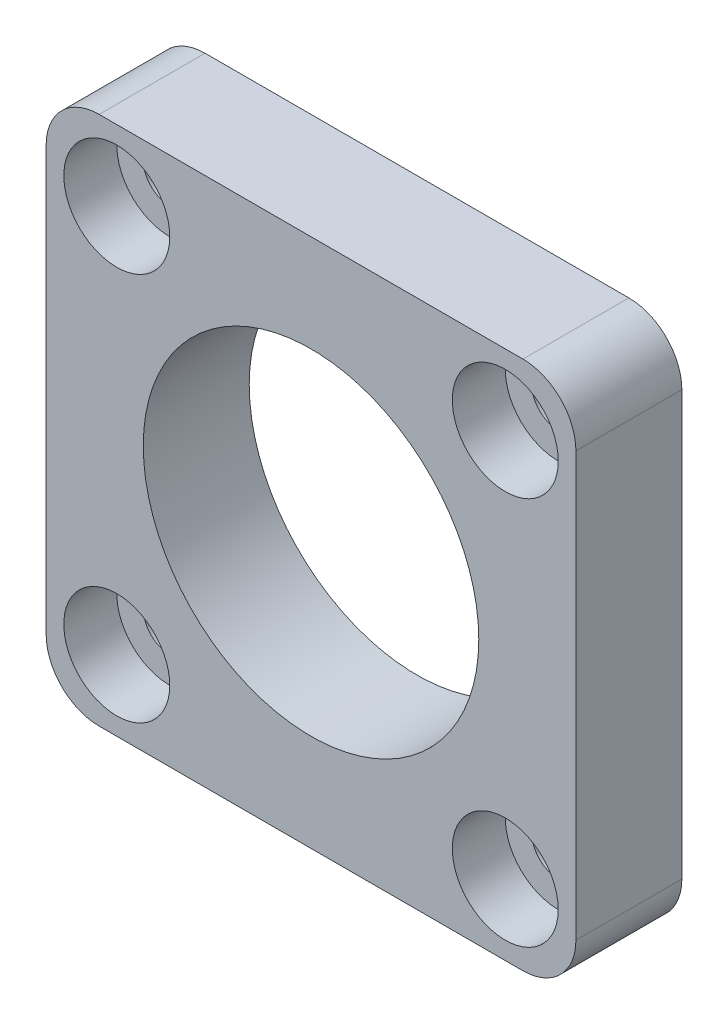
ISO-10303-21;
HEADER;
FILE_DESCRIPTION(('STEP AP214'),'2;1');
FILE_NAME('part.step','',(''),(''),'','','');
FILE_SCHEMA(('AUTOMOTIVE_DESIGN { 1 0 10303 214 1 1 1 1 }'));
ENDSEC;
DATA;
#1=APPLICATION_CONTEXT('core data for automotive mechanical design processes');
#2=APPLICATION_PROTOCOL_DEFINITION('international standard','automotive_design',2000,#1);
#3=PRODUCT_CONTEXT('',#1,'mechanical');
#4=PRODUCT('Part','Part','',(#3));
#5=PRODUCT_RELATED_PRODUCT_CATEGORY('part','',(#4));
#6=PRODUCT_DEFINITION_FORMATION('','',#4);
#7=PRODUCT_DEFINITION_CONTEXT('part definition',#1,'design');
#8=PRODUCT_DEFINITION('design','',#6,#7);
#9=PRODUCT_DEFINITION_SHAPE('','',#8);
#10=(LENGTH_UNIT() NAMED_UNIT(*) SI_UNIT(.MILLI.,.METRE.));
#11=(NAMED_UNIT(*) PLANE_ANGLE_UNIT() SI_UNIT($,.RADIAN.));
#12=(NAMED_UNIT(*) SI_UNIT($,.STERADIAN.) SOLID_ANGLE_UNIT());
#13=UNCERTAINTY_MEASURE_WITH_UNIT(LENGTH_MEASURE(1.E-05),#10,'distance_accuracy_value','');
#14=(GEOMETRIC_REPRESENTATION_CONTEXT(3) GLOBAL_UNCERTAINTY_ASSIGNED_CONTEXT((#13)) GLOBAL_UNIT_ASSIGNED_CONTEXT((#10,
#11,#12)) REPRESENTATION_CONTEXT('',''));
#15=CARTESIAN_POINT('',(0.,0.,0.));
#16=DIRECTION('',(0.,0.,1.));
#17=DIRECTION('',(1.,0.,0.));
#18=AXIS2_PLACEMENT_3D('',#15,#16,#17);
#19=CARTESIAN_POINT('',(-11.,-11.,0.));
#20=DIRECTION('',(0.,0.,1.));
#21=DIRECTION('',(1.,0.,0.));
#22=AXIS2_PLACEMENT_3D('',#19,#20,#21);
#23=CYLINDRICAL_SURFACE('',#22,1.5);
#24=CARTESIAN_POINT('',(-11.,-11.,0.));
#25=DIRECTION('',(0.,0.,1.));
#26=DIRECTION('',(1.,0.,0.));
#27=AXIS2_PLACEMENT_3D('',#24,#25,#26);
#28=CIRCLE('',#27,1.5);
#29=CARTESIAN_POINT('',(-9.5,-11.,0.));
#30=VERTEX_POINT('',#29);
#31=EDGE_CURVE('E137',#30,#30,#28,.T.);
#32=ORIENTED_EDGE('',*,*,#31,.F.);
#33=EDGE_LOOP('',(#32));
#34=FACE_BOUND('',#33,.T.);
#35=CARTESIAN_POINT('',(-11.,-11.,3.));
#36=DIRECTION('',(0.,0.,1.));
#37=DIRECTION('',(1.,0.,0.));
#38=AXIS2_PLACEMENT_3D('',#35,#36,#37);
#39=CIRCLE('',#38,1.5);
#40=CARTESIAN_POINT('',(-9.5,-11.,3.));
#41=VERTEX_POINT('',#40);
#42=EDGE_CURVE('E149',#41,#41,#39,.F.);
#43=ORIENTED_EDGE('',*,*,#42,.F.);
#44=EDGE_LOOP('',(#43));
#45=FACE_BOUND('',#44,.T.);
#46=ADVANCED_FACE('F32',(#34,#45),#23,.F.);
#47=CARTESIAN_POINT('',(11.,-11.,0.));
#48=DIRECTION('',(0.,0.,1.));
#49=DIRECTION('',(1.,0.,0.));
#50=AXIS2_PLACEMENT_3D('',#47,#48,#49);
#51=CYLINDRICAL_SURFACE('',#50,1.5);
#52=CARTESIAN_POINT('',(11.,-11.,0.));
#53=DIRECTION('',(0.,0.,1.));
#54=DIRECTION('',(1.,0.,0.));
#55=AXIS2_PLACEMENT_3D('',#52,#53,#54);
#56=CIRCLE('',#55,1.5);
#57=CARTESIAN_POINT('',(12.5,-11.,0.));
#58=VERTEX_POINT('',#57);
#59=EDGE_CURVE('E202',#58,#58,#56,.T.);
#60=ORIENTED_EDGE('',*,*,#59,.F.);
#61=EDGE_LOOP('',(#60));
#62=FACE_BOUND('',#61,.T.);
#63=CARTESIAN_POINT('',(11.,-11.,3.));
#64=DIRECTION('',(0.,0.,1.));
#65=DIRECTION('',(1.,0.,0.));
#66=AXIS2_PLACEMENT_3D('',#63,#64,#65);
#67=CIRCLE('',#66,1.5);
#68=CARTESIAN_POINT('',(12.5,-11.,3.));
#69=VERTEX_POINT('',#68);
#70=EDGE_CURVE('E144',#69,#69,#67,.F.);
#71=ORIENTED_EDGE('',*,*,#70,.F.);
#72=EDGE_LOOP('',(#71));
#73=FACE_BOUND('',#72,.T.);
#74=ADVANCED_FACE('F265',(#62,#73),#51,.F.);
#75=CARTESIAN_POINT('',(11.,11.,0.));
#76=DIRECTION('',(0.,0.,1.));
#77=DIRECTION('',(1.,0.,0.));
#78=AXIS2_PLACEMENT_3D('',#75,#76,#77);
#79=CYLINDRICAL_SURFACE('',#78,1.5);
#80=CARTESIAN_POINT('',(11.,11.,0.));
#81=DIRECTION('',(0.,0.,1.));
#82=DIRECTION('',(1.,0.,0.));
#83=AXIS2_PLACEMENT_3D('',#80,#81,#82);
#84=CIRCLE('',#83,1.5);
#85=CARTESIAN_POINT('',(12.5,11.,0.));
#86=VERTEX_POINT('',#85);
#87=EDGE_CURVE('E199',#86,#86,#84,.T.);
#88=ORIENTED_EDGE('',*,*,#87,.F.);
#89=EDGE_LOOP('',(#88));
#90=FACE_BOUND('',#89,.T.);
#91=CARTESIAN_POINT('',(11.,11.,3.));
#92=DIRECTION('',(0.,0.,1.));
#93=DIRECTION('',(1.,0.,0.));
#94=AXIS2_PLACEMENT_3D('',#91,#92,#93);
#95=CIRCLE('',#94,1.5);
#96=CARTESIAN_POINT('',(12.5,11.,3.));
#97=VERTEX_POINT('',#96);
#98=EDGE_CURVE('E139',#97,#97,#95,.F.);
#99=ORIENTED_EDGE('',*,*,#98,.F.);
#100=EDGE_LOOP('',(#99));
#101=FACE_BOUND('',#100,.T.);
#102=ADVANCED_FACE('F271',(#90,#101),#79,.F.);
#103=CARTESIAN_POINT('',(-11.,11.,0.));
#104=DIRECTION('',(0.,0.,1.));
#105=DIRECTION('',(1.,0.,0.));
#106=AXIS2_PLACEMENT_3D('',#103,#104,#105);
#107=CYLINDRICAL_SURFACE('',#106,1.5);
#108=CARTESIAN_POINT('',(-11.,11.,0.));
#109=DIRECTION('',(0.,0.,1.));
#110=DIRECTION('',(1.,0.,0.));
#111=AXIS2_PLACEMENT_3D('',#108,#109,#110);
#112=CIRCLE('',#111,1.5);
#113=CARTESIAN_POINT('',(-9.5,11.,0.));
#114=VERTEX_POINT('',#113);
#115=EDGE_CURVE('E195',#114,#114,#112,.T.);
#116=ORIENTED_EDGE('',*,*,#115,.F.);
#117=EDGE_LOOP('',(#116));
#118=FACE_BOUND('',#117,.T.);
#119=CARTESIAN_POINT('',(-11.,11.,3.));
#120=DIRECTION('',(0.,0.,1.));
#121=DIRECTION('',(1.,0.,0.));
#122=AXIS2_PLACEMENT_3D('',#119,#120,#121);
#123=CIRCLE('',#122,1.5);
#124=CARTESIAN_POINT('',(-9.5,11.,3.));
#125=VERTEX_POINT('',#124);
#126=EDGE_CURVE('E134',#125,#125,#123,.F.);
#127=ORIENTED_EDGE('',*,*,#126,.F.);
#128=EDGE_LOOP('',(#127));
#129=FACE_BOUND('',#128,.T.);
#130=ADVANCED_FACE('F237',(#118,#129),#107,.F.);
#131=CARTESIAN_POINT('',(0.,0.,6.));
#132=DIRECTION('',(0.,0.,-1.));
#133=DIRECTION('',(-1.,0.,0.));
#134=AXIS2_PLACEMENT_3D('',#131,#132,#133);
#135=PLANE('',#134);
#136=CARTESIAN_POINT('',(-11.,-11.,6.));
#137=DIRECTION('',(0.,0.,1.));
#138=DIRECTION('',(1.,0.,0.));
#139=AXIS2_PLACEMENT_3D('',#136,#137,#138);
#140=CIRCLE('',#139,3.);
#141=CARTESIAN_POINT('',(-8.,-11.,6.));
#142=VERTEX_POINT('',#141);
#143=EDGE_CURVE('E219',#142,#142,#140,.T.);
#144=ORIENTED_EDGE('',*,*,#143,.F.);
#145=EDGE_LOOP('',(#144));
#146=FACE_BOUND('',#145,.T.);
#147=CARTESIAN_POINT('',(11.,-11.,6.));
#148=DIRECTION('',(0.,0.,1.));
#149=DIRECTION('',(1.,0.,0.));
#150=AXIS2_PLACEMENT_3D('',#147,#148,#149);
#151=CIRCLE('',#150,3.);
#152=CARTESIAN_POINT('',(14.,-11.,6.));
#153=VERTEX_POINT('',#152);
#154=EDGE_CURVE('E152',#153,#153,#151,.T.);
#155=ORIENTED_EDGE('',*,*,#154,.F.);
#156=EDGE_LOOP('',(#155));
#157=FACE_BOUND('',#156,.T.);
#158=CARTESIAN_POINT('',(11.,11.,6.));
#159=DIRECTION('',(0.,0.,1.));
#160=DIRECTION('',(1.,0.,0.));
#161=AXIS2_PLACEMENT_3D('',#158,#159,#160);
#162=CIRCLE('',#161,3.);
#163=CARTESIAN_POINT('',(14.,11.,6.));
#164=VERTEX_POINT('',#163);
#165=EDGE_CURVE('E147',#164,#164,#162,.T.);
#166=ORIENTED_EDGE('',*,*,#165,.F.);
#167=EDGE_LOOP('',(#166));
#168=FACE_BOUND('',#167,.T.);
#169=CARTESIAN_POINT('',(-11.,11.,6.));
#170=DIRECTION('',(0.,0.,1.));
#171=DIRECTION('',(1.,0.,0.));
#172=AXIS2_PLACEMENT_3D('',#169,#170,#171);
#173=CIRCLE('',#172,3.);
#174=CARTESIAN_POINT('',(-8.,11.,6.));
#175=VERTEX_POINT('',#174);
#176=EDGE_CURVE('E142',#175,#175,#173,.T.);
#177=ORIENTED_EDGE('',*,*,#176,.F.);
#178=EDGE_LOOP('',(#177));
#179=FACE_BOUND('',#178,.T.);
#180=DIRECTION('',(0.,-1.,0.));
#181=VECTOR('',#180,1.);
#182=CARTESIAN_POINT('',(-15.,-15.,6.));
#183=LINE('',#182,#181);
#184=CARTESIAN_POINT('',(-15.,12.,6.));
#185=VERTEX_POINT('',#184);
#186=CARTESIAN_POINT('',(-15.,-12.,6.));
#187=VERTEX_POINT('',#186);
#188=EDGE_CURVE('E190',#185,#187,#183,.T.);
#189=ORIENTED_EDGE('',*,*,#188,.T.);
#190=CARTESIAN_POINT('',(-12.,-12.,6.));
#191=DIRECTION('',(0.,0.,-1.));
#192=DIRECTION('',(-1.,0.,0.));
#193=AXIS2_PLACEMENT_3D('',#190,#191,#192);
#194=CIRCLE('',#193,3.);
#195=CARTESIAN_POINT('',(-12.,-15.,6.));
#196=VERTEX_POINT('',#195);
#197=EDGE_CURVE('E167',#187,#196,#194,.F.);
#198=ORIENTED_EDGE('',*,*,#197,.T.);
#199=DIRECTION('',(1.,0.,0.));
#200=VECTOR('',#199,1.);
#201=CARTESIAN_POINT('',(-15.,-15.,6.));
#202=LINE('',#201,#200);
#203=CARTESIAN_POINT('',(12.,-15.,6.));
#204=VERTEX_POINT('',#203);
#205=EDGE_CURVE('E118',#196,#204,#202,.T.);
#206=ORIENTED_EDGE('',*,*,#205,.T.);
#207=CARTESIAN_POINT('',(12.,-12.,6.));
#208=DIRECTION('',(0.,0.,-1.));
#209=DIRECTION('',(-1.,0.,0.));
#210=AXIS2_PLACEMENT_3D('',#207,#208,#209);
#211=CIRCLE('',#210,3.);
#212=CARTESIAN_POINT('',(15.,-12.,6.));
#213=VERTEX_POINT('',#212);
#214=EDGE_CURVE('E165',#204,#213,#211,.F.);
#215=ORIENTED_EDGE('',*,*,#214,.T.);
#216=DIRECTION('',(0.,1.,0.));
#217=VECTOR('',#216,1.);
#218=CARTESIAN_POINT('',(15.,-15.,6.));
#219=LINE('',#218,#217);
#220=CARTESIAN_POINT('',(15.,12.,6.));
#221=VERTEX_POINT('',#220);
#222=EDGE_CURVE('E125',#213,#221,#219,.T.);
#223=ORIENTED_EDGE('',*,*,#222,.T.);
#224=CARTESIAN_POINT('',(12.,12.,6.));
#225=DIRECTION('',(0.,0.,-1.));
#226=DIRECTION('',(-1.,0.,0.));
#227=AXIS2_PLACEMENT_3D('',#224,#225,#226);
#228=CIRCLE('',#227,3.);
#229=CARTESIAN_POINT('',(12.,15.,6.));
#230=VERTEX_POINT('',#229);
#231=EDGE_CURVE('E53',#221,#230,#228,.F.);
#232=ORIENTED_EDGE('',*,*,#231,.T.);
#233=DIRECTION('',(-1.,0.,0.));
#234=VECTOR('',#233,1.);
#235=CARTESIAN_POINT('',(-15.,15.,6.));
#236=LINE('',#235,#234);
#237=CARTESIAN_POINT('',(-12.,15.,6.));
#238=VERTEX_POINT('',#237);
#239=EDGE_CURVE('E128',#230,#238,#236,.T.);
#240=ORIENTED_EDGE('',*,*,#239,.T.);
#241=CARTESIAN_POINT('',(-12.,12.,6.));
#242=DIRECTION('',(0.,0.,-1.));
#243=DIRECTION('',(-1.,0.,0.));
#244=AXIS2_PLACEMENT_3D('',#241,#242,#243);
#245=CIRCLE('',#244,3.);
#246=EDGE_CURVE('E162',#238,#185,#245,.F.);
#247=ORIENTED_EDGE('',*,*,#246,.T.);
#248=EDGE_LOOP('',(#189,#198,#206,#215,#223,#232,#240,#247));
#249=FACE_BOUND('',#248,.T.);
#250=CARTESIAN_POINT('',(0.,0.,6.));
#251=DIRECTION('',(0.,0.,1.));
#252=DIRECTION('',(1.,0.,0.));
#253=AXIS2_PLACEMENT_3D('',#250,#251,#252);
#254=CIRCLE('',#253,9.5);
#255=CARTESIAN_POINT('',(9.5,0.,6.));
#256=VERTEX_POINT('',#255);
#257=EDGE_CURVE('E183',#256,#256,#254,.T.);
#258=ORIENTED_EDGE('',*,*,#257,.F.);
#259=EDGE_LOOP('',(#258));
#260=FACE_BOUND('',#259,.T.);
#261=ADVANCED_FACE('F234',(#146,#157,#168,#179,#249,#260),#135,.F.);
#262=CARTESIAN_POINT('',(0.,0.,0.));
#263=DIRECTION('',(0.,0.,-1.));
#264=DIRECTION('',(-1.,0.,0.));
#265=AXIS2_PLACEMENT_3D('',#262,#263,#264);
#266=PLANE('',#265);
#267=ORIENTED_EDGE('',*,*,#31,.T.);
#268=EDGE_LOOP('',(#267));
#269=FACE_BOUND('',#268,.T.);
#270=ORIENTED_EDGE('',*,*,#59,.T.);
#271=EDGE_LOOP('',(#270));
#272=FACE_BOUND('',#271,.T.);
#273=ORIENTED_EDGE('',*,*,#87,.T.);
#274=EDGE_LOOP('',(#273));
#275=FACE_BOUND('',#274,.T.);
#276=ORIENTED_EDGE('',*,*,#115,.T.);
#277=EDGE_LOOP('',(#276));
#278=FACE_BOUND('',#277,.T.);
#279=DIRECTION('',(1.,0.,0.));
#280=VECTOR('',#279,1.);
#281=CARTESIAN_POINT('',(-15.,-15.,0.));
#282=LINE('',#281,#280);
#283=CARTESIAN_POINT('',(-12.,-15.,0.));
#284=VERTEX_POINT('',#283);
#285=CARTESIAN_POINT('',(12.,-15.,0.));
#286=VERTEX_POINT('',#285);
#287=EDGE_CURVE('E115',#284,#286,#282,.T.);
#288=ORIENTED_EDGE('',*,*,#287,.F.);
#289=CARTESIAN_POINT('',(-12.,-12.,0.));
#290=DIRECTION('',(0.,0.,-1.));
#291=DIRECTION('',(-1.,0.,0.));
#292=AXIS2_PLACEMENT_3D('',#289,#290,#291);
#293=CIRCLE('',#292,3.);
#294=CARTESIAN_POINT('',(-15.,-12.,0.));
#295=VERTEX_POINT('',#294);
#296=EDGE_CURVE('E98',#284,#295,#293,.T.);
#297=ORIENTED_EDGE('',*,*,#296,.T.);
#298=DIRECTION('',(0.,-1.,0.));
#299=VECTOR('',#298,1.);
#300=CARTESIAN_POINT('',(-15.,-15.,0.));
#301=LINE('',#300,#299);
#302=CARTESIAN_POINT('',(-15.,12.,0.));
#303=VERTEX_POINT('',#302);
#304=EDGE_CURVE('E126',#303,#295,#301,.T.);
#305=ORIENTED_EDGE('',*,*,#304,.F.);
#306=CARTESIAN_POINT('',(-12.,12.,0.));
#307=DIRECTION('',(0.,0.,-1.));
#308=DIRECTION('',(-1.,0.,0.));
#309=AXIS2_PLACEMENT_3D('',#306,#307,#308);
#310=CIRCLE('',#309,3.);
#311=CARTESIAN_POINT('',(-12.,15.,0.));
#312=VERTEX_POINT('',#311);
#313=EDGE_CURVE('E119',#303,#312,#310,.T.);
#314=ORIENTED_EDGE('',*,*,#313,.T.);
#315=DIRECTION('',(-1.,0.,0.));
#316=VECTOR('',#315,1.);
#317=CARTESIAN_POINT('',(-15.,15.,0.));
#318=LINE('',#317,#316);
#319=CARTESIAN_POINT('',(12.,15.,0.));
#320=VERTEX_POINT('',#319);
#321=EDGE_CURVE('E130',#320,#312,#318,.T.);
#322=ORIENTED_EDGE('',*,*,#321,.F.);
#323=CARTESIAN_POINT('',(12.,12.,0.));
#324=DIRECTION('',(0.,0.,-1.));
#325=DIRECTION('',(-1.,0.,0.));
#326=AXIS2_PLACEMENT_3D('',#323,#324,#325);
#327=CIRCLE('',#326,3.);
#328=CARTESIAN_POINT('',(15.,12.,0.));
#329=VERTEX_POINT('',#328);
#330=EDGE_CURVE('E156',#320,#329,#327,.T.);
#331=ORIENTED_EDGE('',*,*,#330,.T.);
#332=DIRECTION('',(0.,1.,0.));
#333=VECTOR('',#332,1.);
#334=CARTESIAN_POINT('',(15.,-15.,0.));
#335=LINE('',#334,#333);
#336=CARTESIAN_POINT('',(15.,-12.,0.));
#337=VERTEX_POINT('',#336);
#338=EDGE_CURVE('E178',#337,#329,#335,.T.);
#339=ORIENTED_EDGE('',*,*,#338,.F.);
#340=CARTESIAN_POINT('',(12.,-12.,0.));
#341=DIRECTION('',(0.,0.,-1.));
#342=DIRECTION('',(-1.,0.,0.));
#343=AXIS2_PLACEMENT_3D('',#340,#341,#342);
#344=CIRCLE('',#343,3.);
#345=EDGE_CURVE('E109',#337,#286,#344,.T.);
#346=ORIENTED_EDGE('',*,*,#345,.T.);
#347=EDGE_LOOP('',(#288,#297,#305,#314,#322,#331,#339,#346));
#348=FACE_BOUND('',#347,.T.);
#349=CARTESIAN_POINT('',(0.,0.,0.));
#350=DIRECTION('',(0.,0.,1.));
#351=DIRECTION('',(1.,0.,0.));
#352=AXIS2_PLACEMENT_3D('',#349,#350,#351);
#353=CIRCLE('',#352,9.5);
#354=CARTESIAN_POINT('',(9.5,0.,0.));
#355=VERTEX_POINT('',#354);
#356=EDGE_CURVE('E186',#355,#355,#353,.T.);
#357=ORIENTED_EDGE('',*,*,#356,.T.);
#358=EDGE_LOOP('',(#357));
#359=FACE_BOUND('',#358,.T.);
#360=ADVANCED_FACE('F122',(#269,#272,#275,#278,#348,#359),#266,.T.);
#361=CARTESIAN_POINT('',(15.,-15.,6.));
#362=DIRECTION('',(-1.,0.,0.));
#363=DIRECTION('',(0.,0.,1.));
#364=AXIS2_PLACEMENT_3D('',#361,#362,#363);
#365=PLANE('',#364);
#366=ORIENTED_EDGE('',*,*,#222,.F.);
#367=DIRECTION('',(0.,0.,-1.));
#368=VECTOR('',#367,1.);
#369=CARTESIAN_POINT('',(15.,-12.,6.));
#370=LINE('',#369,#368);
#371=EDGE_CURVE('E171',#213,#337,#370,.T.);
#372=ORIENTED_EDGE('',*,*,#371,.T.);
#373=ORIENTED_EDGE('',*,*,#338,.T.);
#374=DIRECTION('',(0.,0.,-1.));
#375=VECTOR('',#374,1.);
#376=CARTESIAN_POINT('',(15.,12.,6.));
#377=LINE('',#376,#375);
#378=EDGE_CURVE('E169',#329,#221,#377,.F.);
#379=ORIENTED_EDGE('',*,*,#378,.T.);
#380=EDGE_LOOP('',(#366,#372,#373,#379));
#381=FACE_BOUND('',#380,.T.);
#382=ADVANCED_FACE('F177',(#381),#365,.F.);
#383=CARTESIAN_POINT('',(-15.,15.,6.));
#384=DIRECTION('',(0.,-1.,0.));
#385=DIRECTION('',(0.,0.,-1.));
#386=AXIS2_PLACEMENT_3D('',#383,#384,#385);
#387=PLANE('',#386);
#388=ORIENTED_EDGE('',*,*,#239,.F.);
#389=DIRECTION('',(0.,0.,-1.));
#390=VECTOR('',#389,1.);
#391=CARTESIAN_POINT('',(12.,15.,6.));
#392=LINE('',#391,#390);
#393=EDGE_CURVE('E11',#230,#320,#392,.T.);
#394=ORIENTED_EDGE('',*,*,#393,.T.);
#395=ORIENTED_EDGE('',*,*,#321,.T.);
#396=DIRECTION('',(0.,0.,-1.));
#397=VECTOR('',#396,1.);
#398=CARTESIAN_POINT('',(-12.,15.,6.));
#399=LINE('',#398,#397);
#400=EDGE_CURVE('E40',#312,#238,#399,.F.);
#401=ORIENTED_EDGE('',*,*,#400,.T.);
#402=EDGE_LOOP('',(#388,#394,#395,#401));
#403=FACE_BOUND('',#402,.T.);
#404=ADVANCED_FACE('F260',(#403),#387,.F.);
#405=CARTESIAN_POINT('',(-15.,-15.,6.));
#406=DIRECTION('',(1.,0.,0.));
#407=DIRECTION('',(0.,0.,-1.));
#408=AXIS2_PLACEMENT_3D('',#405,#406,#407);
#409=PLANE('',#408);
#410=ORIENTED_EDGE('',*,*,#304,.T.);
#411=DIRECTION('',(0.,0.,-1.));
#412=VECTOR('',#411,1.);
#413=CARTESIAN_POINT('',(-15.,-12.,6.));
#414=LINE('',#413,#412);
#415=EDGE_CURVE('E103',#295,#187,#414,.F.);
#416=ORIENTED_EDGE('',*,*,#415,.T.);
#417=ORIENTED_EDGE('',*,*,#188,.F.);
#418=DIRECTION('',(0.,0.,-1.));
#419=VECTOR('',#418,1.);
#420=CARTESIAN_POINT('',(-15.,12.,6.));
#421=LINE('',#420,#419);
#422=EDGE_CURVE('E108',#185,#303,#421,.T.);
#423=ORIENTED_EDGE('',*,*,#422,.T.);
#424=EDGE_LOOP('',(#410,#416,#417,#423));
#425=FACE_BOUND('',#424,.T.);
#426=ADVANCED_FACE('F421',(#425),#409,.F.);
#427=CARTESIAN_POINT('',(-15.,-15.,6.));
#428=DIRECTION('',(0.,1.,0.));
#429=DIRECTION('',(0.,0.,1.));
#430=AXIS2_PLACEMENT_3D('',#427,#428,#429);
#431=PLANE('',#430);
#432=ORIENTED_EDGE('',*,*,#205,.F.);
#433=DIRECTION('',(0.,0.,-1.));
#434=VECTOR('',#433,1.);
#435=CARTESIAN_POINT('',(-12.,-15.,6.));
#436=LINE('',#435,#434);
#437=EDGE_CURVE('E102',#196,#284,#436,.T.);
#438=ORIENTED_EDGE('',*,*,#437,.T.);
#439=ORIENTED_EDGE('',*,*,#287,.T.);
#440=DIRECTION('',(0.,0.,-1.));
#441=VECTOR('',#440,1.);
#442=CARTESIAN_POINT('',(12.,-15.,6.));
#443=LINE('',#442,#441);
#444=EDGE_CURVE('E120',#286,#204,#443,.F.);
#445=ORIENTED_EDGE('',*,*,#444,.T.);
#446=EDGE_LOOP('',(#432,#438,#439,#445));
#447=FACE_BOUND('',#446,.T.);
#448=ADVANCED_FACE('F114',(#447),#431,.F.);
#449=CARTESIAN_POINT('',(0.,0.,6.));
#450=DIRECTION('',(0.,0.,-1.));
#451=DIRECTION('',(-1.,0.,0.));
#452=AXIS2_PLACEMENT_3D('',#449,#450,#451);
#453=CYLINDRICAL_SURFACE('',#452,9.5);
#454=ORIENTED_EDGE('',*,*,#257,.T.);
#455=EDGE_LOOP('',(#454));
#456=FACE_BOUND('',#455,.T.);
#457=ORIENTED_EDGE('',*,*,#356,.F.);
#458=EDGE_LOOP('',(#457));
#459=FACE_BOUND('',#458,.T.);
#460=ADVANCED_FACE('F248',(#456,#459),#453,.F.);
#461=CARTESIAN_POINT('',(-11.,11.,3.));
#462=DIRECTION('',(0.,0.,1.));
#463=DIRECTION('',(1.,0.,0.));
#464=AXIS2_PLACEMENT_3D('',#461,#462,#463);
#465=PLANE('',#464);
#466=CARTESIAN_POINT('',(-11.,11.,3.));
#467=DIRECTION('',(0.,0.,1.));
#468=DIRECTION('',(1.,0.,0.));
#469=AXIS2_PLACEMENT_3D('',#466,#467,#468);
#470=CIRCLE('',#469,3.);
#471=CARTESIAN_POINT('',(-8.,11.,3.));
#472=VERTEX_POINT('',#471);
#473=EDGE_CURVE('E138',#472,#472,#470,.T.);
#474=ORIENTED_EDGE('',*,*,#473,.T.);
#475=EDGE_LOOP('',(#474));
#476=FACE_BOUND('',#475,.T.);
#477=ORIENTED_EDGE('',*,*,#126,.T.);
#478=EDGE_LOOP('',(#477));
#479=FACE_BOUND('',#478,.T.);
#480=ADVANCED_FACE('F251',(#476,#479),#465,.T.);
#481=CARTESIAN_POINT('',(-11.,11.,3.));
#482=DIRECTION('',(0.,0.,1.));
#483=DIRECTION('',(1.,0.,0.));
#484=AXIS2_PLACEMENT_3D('',#481,#482,#483);
#485=CYLINDRICAL_SURFACE('',#484,3.);
#486=ORIENTED_EDGE('',*,*,#473,.F.);
#487=EDGE_LOOP('',(#486));
#488=FACE_BOUND('',#487,.T.);
#489=ORIENTED_EDGE('',*,*,#176,.T.);
#490=EDGE_LOOP('',(#489));
#491=FACE_BOUND('',#490,.T.);
#492=ADVANCED_FACE('F277',(#488,#491),#485,.F.);
#493=CARTESIAN_POINT('',(11.,11.,3.));
#494=DIRECTION('',(0.,0.,1.));
#495=DIRECTION('',(1.,0.,0.));
#496=AXIS2_PLACEMENT_3D('',#493,#494,#495);
#497=PLANE('',#496);
#498=CARTESIAN_POINT('',(11.,11.,3.));
#499=DIRECTION('',(0.,0.,1.));
#500=DIRECTION('',(1.,0.,0.));
#501=AXIS2_PLACEMENT_3D('',#498,#499,#500);
#502=CIRCLE('',#501,3.);
#503=CARTESIAN_POINT('',(14.,11.,3.));
#504=VERTEX_POINT('',#503);
#505=EDGE_CURVE('E143',#504,#504,#502,.T.);
#506=ORIENTED_EDGE('',*,*,#505,.T.);
#507=EDGE_LOOP('',(#506));
#508=FACE_BOUND('',#507,.T.);
#509=ORIENTED_EDGE('',*,*,#98,.T.);
#510=EDGE_LOOP('',(#509));
#511=FACE_BOUND('',#510,.T.);
#512=ADVANCED_FACE('F296',(#508,#511),#497,.T.);
#513=CARTESIAN_POINT('',(11.,11.,3.));
#514=DIRECTION('',(0.,0.,1.));
#515=DIRECTION('',(1.,0.,0.));
#516=AXIS2_PLACEMENT_3D('',#513,#514,#515);
#517=CYLINDRICAL_SURFACE('',#516,3.);
#518=ORIENTED_EDGE('',*,*,#505,.F.);
#519=EDGE_LOOP('',(#518));
#520=FACE_BOUND('',#519,.T.);
#521=ORIENTED_EDGE('',*,*,#165,.T.);
#522=EDGE_LOOP('',(#521));
#523=FACE_BOUND('',#522,.T.);
#524=ADVANCED_FACE('F299',(#520,#523),#517,.F.);
#525=CARTESIAN_POINT('',(11.,-11.,3.));
#526=DIRECTION('',(0.,0.,1.));
#527=DIRECTION('',(1.,0.,0.));
#528=AXIS2_PLACEMENT_3D('',#525,#526,#527);
#529=PLANE('',#528);
#530=CARTESIAN_POINT('',(11.,-11.,3.));
#531=DIRECTION('',(0.,0.,1.));
#532=DIRECTION('',(1.,0.,0.));
#533=AXIS2_PLACEMENT_3D('',#530,#531,#532);
#534=CIRCLE('',#533,3.);
#535=CARTESIAN_POINT('',(14.,-11.,3.));
#536=VERTEX_POINT('',#535);
#537=EDGE_CURVE('E148',#536,#536,#534,.T.);
#538=ORIENTED_EDGE('',*,*,#537,.T.);
#539=EDGE_LOOP('',(#538));
#540=FACE_BOUND('',#539,.T.);
#541=ORIENTED_EDGE('',*,*,#70,.T.);
#542=EDGE_LOOP('',(#541));
#543=FACE_BOUND('',#542,.T.);
#544=ADVANCED_FACE('F302',(#540,#543),#529,.T.);
#545=CARTESIAN_POINT('',(11.,-11.,3.));
#546=DIRECTION('',(0.,0.,1.));
#547=DIRECTION('',(1.,0.,0.));
#548=AXIS2_PLACEMENT_3D('',#545,#546,#547);
#549=CYLINDRICAL_SURFACE('',#548,3.);
#550=ORIENTED_EDGE('',*,*,#537,.F.);
#551=EDGE_LOOP('',(#550));
#552=FACE_BOUND('',#551,.T.);
#553=ORIENTED_EDGE('',*,*,#154,.T.);
#554=EDGE_LOOP('',(#553));
#555=FACE_BOUND('',#554,.T.);
#556=ADVANCED_FACE('F307',(#552,#555),#549,.F.);
#557=CARTESIAN_POINT('',(-11.,-11.,3.));
#558=DIRECTION('',(0.,0.,1.));
#559=DIRECTION('',(1.,0.,0.));
#560=AXIS2_PLACEMENT_3D('',#557,#558,#559);
#561=PLANE('',#560);
#562=CARTESIAN_POINT('',(-11.,-11.,3.));
#563=DIRECTION('',(0.,0.,1.));
#564=DIRECTION('',(1.,0.,0.));
#565=AXIS2_PLACEMENT_3D('',#562,#563,#564);
#566=CIRCLE('',#565,3.);
#567=CARTESIAN_POINT('',(-8.,-11.,3.));
#568=VERTEX_POINT('',#567);
#569=EDGE_CURVE('E153',#568,#568,#566,.T.);
#570=ORIENTED_EDGE('',*,*,#569,.T.);
#571=EDGE_LOOP('',(#570));
#572=FACE_BOUND('',#571,.T.);
#573=ORIENTED_EDGE('',*,*,#42,.T.);
#574=EDGE_LOOP('',(#573));
#575=FACE_BOUND('',#574,.T.);
#576=ADVANCED_FACE('F225',(#572,#575),#561,.T.);
#577=CARTESIAN_POINT('',(-11.,-11.,3.));
#578=DIRECTION('',(0.,0.,1.));
#579=DIRECTION('',(1.,0.,0.));
#580=AXIS2_PLACEMENT_3D('',#577,#578,#579);
#581=CYLINDRICAL_SURFACE('',#580,3.);
#582=ORIENTED_EDGE('',*,*,#569,.F.);
#583=EDGE_LOOP('',(#582));
#584=FACE_BOUND('',#583,.T.);
#585=ORIENTED_EDGE('',*,*,#143,.T.);
#586=EDGE_LOOP('',(#585));
#587=FACE_BOUND('',#586,.T.);
#588=ADVANCED_FACE('F228',(#584,#587),#581,.F.);
#589=CARTESIAN_POINT('',(-12.,-12.,6.));
#590=DIRECTION('',(0.,0.,-1.));
#591=DIRECTION('',(-1.,0.,0.));
#592=AXIS2_PLACEMENT_3D('',#589,#590,#591);
#593=CYLINDRICAL_SURFACE('',#592,3.);
#594=ORIENTED_EDGE('',*,*,#197,.F.);
#595=ORIENTED_EDGE('',*,*,#415,.F.);
#596=ORIENTED_EDGE('',*,*,#296,.F.);
#597=ORIENTED_EDGE('',*,*,#437,.F.);
#598=EDGE_LOOP('',(#594,#595,#596,#597));
#599=FACE_BOUND('',#598,.T.);
#600=ADVANCED_FACE('F101',(#599),#593,.T.);
#601=CARTESIAN_POINT('',(12.,-12.,6.));
#602=DIRECTION('',(0.,0.,-1.));
#603=DIRECTION('',(-1.,0.,0.));
#604=AXIS2_PLACEMENT_3D('',#601,#602,#603);
#605=CYLINDRICAL_SURFACE('',#604,3.);
#606=ORIENTED_EDGE('',*,*,#214,.F.);
#607=ORIENTED_EDGE('',*,*,#444,.F.);
#608=ORIENTED_EDGE('',*,*,#345,.F.);
#609=ORIENTED_EDGE('',*,*,#371,.F.);
#610=EDGE_LOOP('',(#606,#607,#608,#609));
#611=FACE_BOUND('',#610,.T.);
#612=ADVANCED_FACE('F330',(#611),#605,.T.);
#613=CARTESIAN_POINT('',(12.,12.,6.));
#614=DIRECTION('',(0.,0.,-1.));
#615=DIRECTION('',(-1.,0.,0.));
#616=AXIS2_PLACEMENT_3D('',#613,#614,#615);
#617=CYLINDRICAL_SURFACE('',#616,3.);
#618=ORIENTED_EDGE('',*,*,#231,.F.);
#619=ORIENTED_EDGE('',*,*,#378,.F.);
#620=ORIENTED_EDGE('',*,*,#330,.F.);
#621=ORIENTED_EDGE('',*,*,#393,.F.);
#622=EDGE_LOOP('',(#618,#619,#620,#621));
#623=FACE_BOUND('',#622,.T.);
#624=ADVANCED_FACE('F338',(#623),#617,.T.);
#625=CARTESIAN_POINT('',(-12.,12.,6.));
#626=DIRECTION('',(0.,0.,-1.));
#627=DIRECTION('',(-1.,0.,0.));
#628=AXIS2_PLACEMENT_3D('',#625,#626,#627);
#629=CYLINDRICAL_SURFACE('',#628,3.);
#630=ORIENTED_EDGE('',*,*,#246,.F.);
#631=ORIENTED_EDGE('',*,*,#400,.F.);
#632=ORIENTED_EDGE('',*,*,#313,.F.);
#633=ORIENTED_EDGE('',*,*,#422,.F.);
#634=EDGE_LOOP('',(#630,#631,#632,#633));
#635=FACE_BOUND('',#634,.T.);
#636=ADVANCED_FACE('F34',(#635),#629,.T.);
#637=CLOSED_SHELL('',(#46,#74,#102,#130,#261,#360,#382,#404,#426,#448,#460,#480,#492,#512,#524,
#544,#556,#576,#588,#600,#612,#624,#636));
#638=MANIFOLD_SOLID_BREP('B2',#637);
#639=ADVANCED_BREP_SHAPE_REPRESENTATION('',(#18,#638),#14);
#640=SHAPE_DEFINITION_REPRESENTATION(#9,#639);
ENDSEC;
END-ISO-10303-21;
